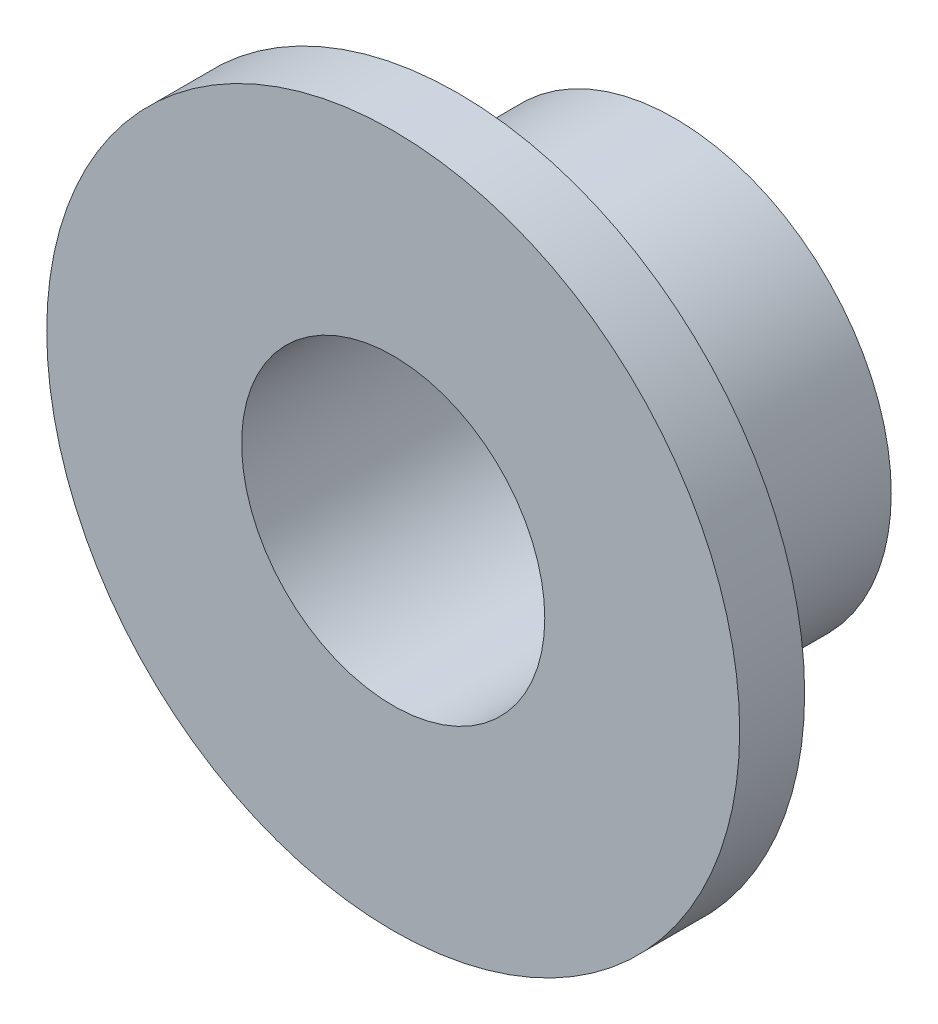
ISO-10303-21;
HEADER;
FILE_DESCRIPTION(('STEP AP214'),'2;1');
FILE_NAME('part.step','',(''),(''),'','','');
FILE_SCHEMA(('AUTOMOTIVE_DESIGN { 1 0 10303 214 1 1 1 1 }'));
ENDSEC;
DATA;
#1=APPLICATION_CONTEXT('core data for automotive mechanical design processes');
#2=APPLICATION_PROTOCOL_DEFINITION('international standard','automotive_design',2000,#1);
#3=PRODUCT_CONTEXT('',#1,'mechanical');
#4=PRODUCT('Part','Part','',(#3));
#5=PRODUCT_RELATED_PRODUCT_CATEGORY('part','',(#4));
#6=PRODUCT_DEFINITION_FORMATION('','',#4);
#7=PRODUCT_DEFINITION_CONTEXT('part definition',#1,'design');
#8=PRODUCT_DEFINITION('design','',#6,#7);
#9=PRODUCT_DEFINITION_SHAPE('','',#8);
#10=(LENGTH_UNIT() NAMED_UNIT(*) SI_UNIT(.MILLI.,.METRE.));
#11=(NAMED_UNIT(*) PLANE_ANGLE_UNIT() SI_UNIT($,.RADIAN.));
#12=(NAMED_UNIT(*) SI_UNIT($,.STERADIAN.) SOLID_ANGLE_UNIT());
#13=UNCERTAINTY_MEASURE_WITH_UNIT(LENGTH_MEASURE(1.E-05),#10,'distance_accuracy_value','');
#14=(GEOMETRIC_REPRESENTATION_CONTEXT(3) GLOBAL_UNCERTAINTY_ASSIGNED_CONTEXT((#13)) GLOBAL_UNIT_ASSIGNED_CONTEXT((#10,
#11,#12)) REPRESENTATION_CONTEXT('',''));
#15=CARTESIAN_POINT('',(0.,0.,0.));
#16=DIRECTION('',(0.,0.,1.));
#17=DIRECTION('',(1.,0.,0.));
#18=AXIS2_PLACEMENT_3D('',#15,#16,#17);
#19=CARTESIAN_POINT('',(0.,0.,0.));
#20=DIRECTION('',(0.,0.,1.));
#21=DIRECTION('',(1.,0.,0.));
#22=AXIS2_PLACEMENT_3D('',#19,#20,#21);
#23=PLANE('',#22);
#24=CARTESIAN_POINT('',(0.,0.,0.));
#25=DIRECTION('',(0.,0.,1.));
#26=DIRECTION('',(1.,0.,0.));
#27=AXIS2_PLACEMENT_3D('',#24,#25,#26);
#28=CIRCLE('',#27,10.);
#29=CARTESIAN_POINT('',(10.,0.,0.));
#30=VERTEX_POINT('',#29);
#31=EDGE_CURVE('E44',#30,#30,#28,.T.);
#32=ORIENTED_EDGE('',*,*,#31,.F.);
#33=EDGE_LOOP('',(#32));
#34=FACE_BOUND('',#33,.T.);
#35=CARTESIAN_POINT('',(0.,0.,0.));
#36=DIRECTION('',(0.,0.,1.));
#37=DIRECTION('',(1.,0.,0.));
#38=AXIS2_PLACEMENT_3D('',#35,#36,#37);
#39=CIRCLE('',#38,7.);
#40=CARTESIAN_POINT('',(7.,0.,0.));
#41=VERTEX_POINT('',#40);
#42=EDGE_CURVE('E51',#41,#41,#39,.T.);
#43=ORIENTED_EDGE('',*,*,#42,.T.);
#44=EDGE_LOOP('',(#43));
#45=FACE_BOUND('',#44,.T.);
#46=ADVANCED_FACE('F40',(#34,#45),#23,.F.);
#47=CARTESIAN_POINT('',(0.,0.,10.));
#48=DIRECTION('',(0.,0.,-1.));
#49=DIRECTION('',(-1.,0.,0.));
#50=AXIS2_PLACEMENT_3D('',#47,#48,#49);
#51=CYLINDRICAL_SURFACE('',#50,10.);
#52=CARTESIAN_POINT('',(0.,0.,10.));
#53=DIRECTION('',(0.,0.,1.));
#54=DIRECTION('',(1.,0.,0.));
#55=AXIS2_PLACEMENT_3D('',#52,#53,#54);
#56=CIRCLE('',#55,10.);
#57=CARTESIAN_POINT('',(10.,0.,10.));
#58=VERTEX_POINT('',#57);
#59=EDGE_CURVE('E10',#58,#58,#56,.T.);
#60=ORIENTED_EDGE('',*,*,#59,.F.);
#61=EDGE_LOOP('',(#60));
#62=FACE_BOUND('',#61,.T.);
#63=ORIENTED_EDGE('',*,*,#31,.T.);
#64=EDGE_LOOP('',(#63));
#65=FACE_BOUND('',#64,.T.);
#66=ADVANCED_FACE('F42',(#62,#65),#51,.T.);
#67=CARTESIAN_POINT('',(0.,0.,10.));
#68=DIRECTION('',(0.,0.,-1.));
#69=DIRECTION('',(-1.,0.,0.));
#70=AXIS2_PLACEMENT_3D('',#67,#68,#69);
#71=CYLINDRICAL_SURFACE('',#70,7.);
#72=ORIENTED_EDGE('',*,*,#42,.F.);
#73=EDGE_LOOP('',(#72));
#74=FACE_BOUND('',#73,.T.);
#75=CARTESIAN_POINT('',(0.,0.,13.));
#76=DIRECTION('',(0.,0.,1.));
#77=DIRECTION('',(1.,0.,0.));
#78=AXIS2_PLACEMENT_3D('',#75,#76,#77);
#79=CIRCLE('',#78,7.);
#80=CARTESIAN_POINT('',(7.,0.,13.));
#81=VERTEX_POINT('',#80);
#82=EDGE_CURVE('E55',#81,#81,#79,.F.);
#83=ORIENTED_EDGE('',*,*,#82,.F.);
#84=EDGE_LOOP('',(#83));
#85=FACE_BOUND('',#84,.T.);
#86=ADVANCED_FACE('F71',(#74,#85),#71,.F.);
#87=CARTESIAN_POINT('',(0.,0.,13.));
#88=DIRECTION('',(0.,0.,-1.));
#89=DIRECTION('',(-1.,0.,0.));
#90=AXIS2_PLACEMENT_3D('',#87,#88,#89);
#91=CYLINDRICAL_SURFACE('',#90,16.);
#92=CARTESIAN_POINT('',(0.,0.,13.));
#93=DIRECTION('',(0.,0.,1.));
#94=DIRECTION('',(1.,0.,0.));
#95=AXIS2_PLACEMENT_3D('',#92,#93,#94);
#96=CIRCLE('',#95,16.);
#97=CARTESIAN_POINT('',(16.,0.,13.));
#98=VERTEX_POINT('',#97);
#99=EDGE_CURVE('E59',#98,#98,#96,.T.);
#100=ORIENTED_EDGE('',*,*,#99,.F.);
#101=EDGE_LOOP('',(#100));
#102=FACE_BOUND('',#101,.T.);
#103=CARTESIAN_POINT('',(0.,0.,10.));
#104=DIRECTION('',(0.,0.,1.));
#105=DIRECTION('',(1.,0.,0.));
#106=AXIS2_PLACEMENT_3D('',#103,#104,#105);
#107=CIRCLE('',#106,16.);
#108=CARTESIAN_POINT('',(16.,0.,10.));
#109=VERTEX_POINT('',#108);
#110=EDGE_CURVE('E56',#109,#109,#107,.T.);
#111=ORIENTED_EDGE('',*,*,#110,.T.);
#112=EDGE_LOOP('',(#111));
#113=FACE_BOUND('',#112,.T.);
#114=ADVANCED_FACE('F68',(#102,#113),#91,.T.);
#115=CARTESIAN_POINT('',(0.,0.,13.));
#116=DIRECTION('',(0.,0.,1.));
#117=DIRECTION('',(1.,0.,0.));
#118=AXIS2_PLACEMENT_3D('',#115,#116,#117);
#119=PLANE('',#118);
#120=ORIENTED_EDGE('',*,*,#99,.T.);
#121=EDGE_LOOP('',(#120));
#122=FACE_BOUND('',#121,.T.);
#123=ORIENTED_EDGE('',*,*,#82,.T.);
#124=EDGE_LOOP('',(#123));
#125=FACE_BOUND('',#124,.T.);
#126=ADVANCED_FACE('F65',(#122,#125),#119,.T.);
#127=CARTESIAN_POINT('',(0.,0.,10.));
#128=DIRECTION('',(0.,0.,1.));
#129=DIRECTION('',(1.,0.,0.));
#130=AXIS2_PLACEMENT_3D('',#127,#128,#129);
#131=PLANE('',#130);
#132=ORIENTED_EDGE('',*,*,#59,.T.);
#133=EDGE_LOOP('',(#132));
#134=FACE_BOUND('',#133,.T.);
#135=ORIENTED_EDGE('',*,*,#110,.F.);
#136=EDGE_LOOP('',(#135));
#137=FACE_BOUND('',#136,.T.);
#138=ADVANCED_FACE('F75',(#134,#137),#131,.F.);
#139=CLOSED_SHELL('',(#46,#66,#86,#114,#126,#138));
#140=MANIFOLD_SOLID_BREP('B2',#139);
#141=ADVANCED_BREP_SHAPE_REPRESENTATION('',(#18,#140),#14);
#142=SHAPE_DEFINITION_REPRESENTATION(#9,#141);
ENDSEC;
END-ISO-10303-21;
